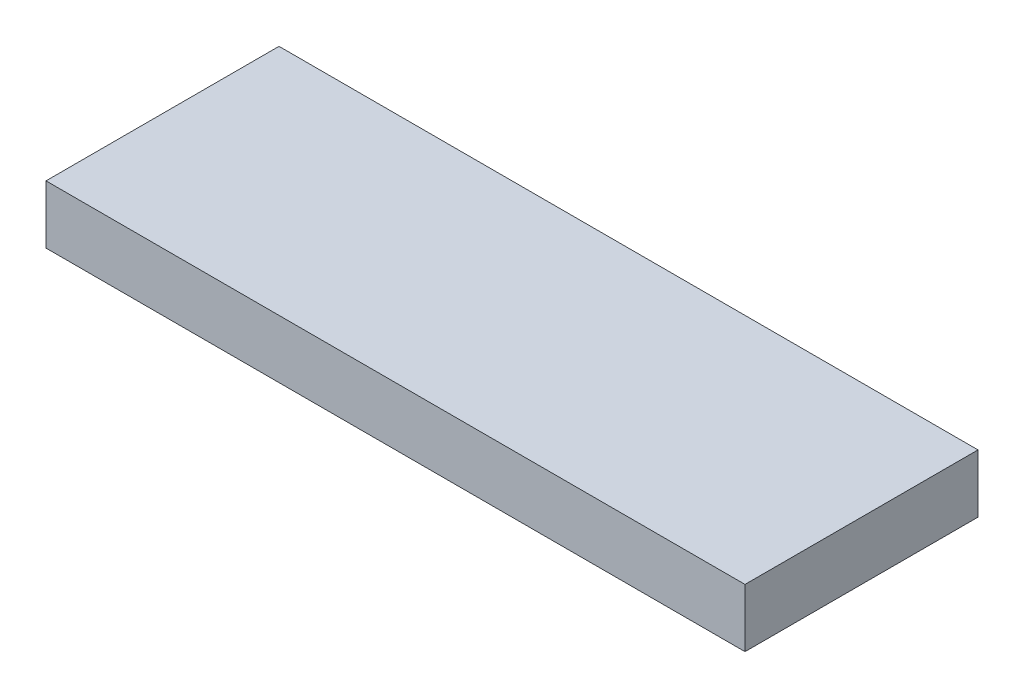
ISO-10303-21;
HEADER;
FILE_DESCRIPTION(('STEP AP214'),'2;1');
FILE_NAME('part.step','',(''),(''),'','','');
FILE_SCHEMA(('AUTOMOTIVE_DESIGN { 1 0 10303 214 1 1 1 1 }'));
ENDSEC;
DATA;
#1=APPLICATION_CONTEXT('core data for automotive mechanical design processes');
#2=APPLICATION_PROTOCOL_DEFINITION('international standard','automotive_design',2000,#1);
#3=PRODUCT_CONTEXT('',#1,'mechanical');
#4=PRODUCT('Part','Part','',(#3));
#5=PRODUCT_RELATED_PRODUCT_CATEGORY('part','',(#4));
#6=PRODUCT_DEFINITION_FORMATION('','',#4);
#7=PRODUCT_DEFINITION_CONTEXT('part definition',#1,'design');
#8=PRODUCT_DEFINITION('design','',#6,#7);
#9=PRODUCT_DEFINITION_SHAPE('','',#8);
#10=(LENGTH_UNIT() NAMED_UNIT(*) SI_UNIT(.MILLI.,.METRE.));
#11=(NAMED_UNIT(*) PLANE_ANGLE_UNIT() SI_UNIT($,.RADIAN.));
#12=(NAMED_UNIT(*) SI_UNIT($,.STERADIAN.) SOLID_ANGLE_UNIT());
#13=UNCERTAINTY_MEASURE_WITH_UNIT(LENGTH_MEASURE(1.E-05),#10,'distance_accuracy_value','');
#14=(GEOMETRIC_REPRESENTATION_CONTEXT(3) GLOBAL_UNCERTAINTY_ASSIGNED_CONTEXT((#13)) GLOBAL_UNIT_ASSIGNED_CONTEXT((#10,
#11,#12)) REPRESENTATION_CONTEXT('',''));
#15=CARTESIAN_POINT('',(0.,0.,0.));
#16=DIRECTION('',(0.,0.,1.));
#17=DIRECTION('',(1.,0.,0.));
#18=AXIS2_PLACEMENT_3D('',#15,#16,#17);
#19=CARTESIAN_POINT('',(-150.,25.,50.));
#20=DIRECTION('',(1.,0.,0.));
#21=DIRECTION('',(0.,0.,-1.));
#22=AXIS2_PLACEMENT_3D('',#19,#20,#21);
#23=PLANE('',#22);
#24=DIRECTION('',(0.,0.,1.));
#25=VECTOR('',#24,1.);
#26=CARTESIAN_POINT('',(-150.,0.,50.));
#27=LINE('',#26,#25);
#28=CARTESIAN_POINT('',(-150.,0.,-50.));
#29=VERTEX_POINT('',#28);
#30=CARTESIAN_POINT('',(-150.,0.,50.));
#31=VERTEX_POINT('',#30);
#32=EDGE_CURVE('E96',#29,#31,#27,.T.);
#33=ORIENTED_EDGE('',*,*,#32,.T.);
#34=DIRECTION('',(0.,-1.,0.));
#35=VECTOR('',#34,1.);
#36=CARTESIAN_POINT('',(-150.,25.,50.));
#37=LINE('',#36,#35);
#38=CARTESIAN_POINT('',(-150.,25.,50.));
#39=VERTEX_POINT('',#38);
#40=EDGE_CURVE('E11',#39,#31,#37,.T.);
#41=ORIENTED_EDGE('',*,*,#40,.F.);
#42=DIRECTION('',(0.,0.,1.));
#43=VECTOR('',#42,1.);
#44=CARTESIAN_POINT('',(-150.,25.,50.));
#45=LINE('',#44,#43);
#46=CARTESIAN_POINT('',(-150.,25.,-50.));
#47=VERTEX_POINT('',#46);
#48=EDGE_CURVE('E84',#47,#39,#45,.T.);
#49=ORIENTED_EDGE('',*,*,#48,.F.);
#50=DIRECTION('',(0.,-1.,0.));
#51=VECTOR('',#50,1.);
#52=CARTESIAN_POINT('',(-150.,25.,-50.));
#53=LINE('',#52,#51);
#54=EDGE_CURVE('E92',#47,#29,#53,.T.);
#55=ORIENTED_EDGE('',*,*,#54,.T.);
#56=EDGE_LOOP('',(#33,#41,#49,#55));
#57=FACE_BOUND('',#56,.T.);
#58=ADVANCED_FACE('F33',(#57),#23,.F.);
#59=CARTESIAN_POINT('',(150.,25.,50.));
#60=DIRECTION('',(0.,0.,-1.));
#61=DIRECTION('',(-1.,0.,0.));
#62=AXIS2_PLACEMENT_3D('',#59,#60,#61);
#63=PLANE('',#62);
#64=DIRECTION('',(1.,0.,0.));
#65=VECTOR('',#64,1.);
#66=CARTESIAN_POINT('',(150.,0.,50.));
#67=LINE('',#66,#65);
#68=CARTESIAN_POINT('',(150.,0.,50.));
#69=VERTEX_POINT('',#68);
#70=EDGE_CURVE('E88',#31,#69,#67,.T.);
#71=ORIENTED_EDGE('',*,*,#70,.T.);
#72=DIRECTION('',(0.,-1.,0.));
#73=VECTOR('',#72,1.);
#74=CARTESIAN_POINT('',(150.,25.,50.));
#75=LINE('',#74,#73);
#76=CARTESIAN_POINT('',(150.,25.,50.));
#77=VERTEX_POINT('',#76);
#78=EDGE_CURVE('E41',#77,#69,#75,.T.);
#79=ORIENTED_EDGE('',*,*,#78,.F.);
#80=DIRECTION('',(1.,0.,0.));
#81=VECTOR('',#80,1.);
#82=CARTESIAN_POINT('',(150.,25.,50.));
#83=LINE('',#82,#81);
#84=EDGE_CURVE('E79',#39,#77,#83,.T.);
#85=ORIENTED_EDGE('',*,*,#84,.F.);
#86=ORIENTED_EDGE('',*,*,#40,.T.);
#87=EDGE_LOOP('',(#71,#79,#85,#86));
#88=FACE_BOUND('',#87,.T.);
#89=ADVANCED_FACE('F87',(#88),#63,.F.);
#90=CARTESIAN_POINT('',(150.,25.,50.));
#91=DIRECTION('',(-1.,0.,0.));
#92=DIRECTION('',(0.,0.,1.));
#93=AXIS2_PLACEMENT_3D('',#90,#91,#92);
#94=PLANE('',#93);
#95=DIRECTION('',(0.,0.,-1.));
#96=VECTOR('',#95,1.);
#97=CARTESIAN_POINT('',(150.,0.,50.));
#98=LINE('',#97,#96);
#99=CARTESIAN_POINT('',(150.,0.,-50.));
#100=VERTEX_POINT('',#99);
#101=EDGE_CURVE('E66',#69,#100,#98,.T.);
#102=ORIENTED_EDGE('',*,*,#101,.T.);
#103=DIRECTION('',(0.,-1.,0.));
#104=VECTOR('',#103,1.);
#105=CARTESIAN_POINT('',(150.,25.,-50.));
#106=LINE('',#105,#104);
#107=CARTESIAN_POINT('',(150.,25.,-50.));
#108=VERTEX_POINT('',#107);
#109=EDGE_CURVE('E89',#108,#100,#106,.T.);
#110=ORIENTED_EDGE('',*,*,#109,.F.);
#111=DIRECTION('',(0.,0.,-1.));
#112=VECTOR('',#111,1.);
#113=CARTESIAN_POINT('',(150.,25.,50.));
#114=LINE('',#113,#112);
#115=EDGE_CURVE('E82',#77,#108,#114,.T.);
#116=ORIENTED_EDGE('',*,*,#115,.F.);
#117=ORIENTED_EDGE('',*,*,#78,.T.);
#118=EDGE_LOOP('',(#102,#110,#116,#117));
#119=FACE_BOUND('',#118,.T.);
#120=ADVANCED_FACE('F90',(#119),#94,.F.);
#121=CARTESIAN_POINT('',(150.,25.,-50.));
#122=DIRECTION('',(0.,0.,1.));
#123=DIRECTION('',(1.,0.,0.));
#124=AXIS2_PLACEMENT_3D('',#121,#122,#123);
#125=PLANE('',#124);
#126=DIRECTION('',(-1.,0.,0.));
#127=VECTOR('',#126,1.);
#128=CARTESIAN_POINT('',(150.,0.,-50.));
#129=LINE('',#128,#127);
#130=EDGE_CURVE('E72',#100,#29,#129,.T.);
#131=ORIENTED_EDGE('',*,*,#130,.T.);
#132=ORIENTED_EDGE('',*,*,#54,.F.);
#133=DIRECTION('',(-1.,0.,0.));
#134=VECTOR('',#133,1.);
#135=CARTESIAN_POINT('',(150.,25.,-50.));
#136=LINE('',#135,#134);
#137=EDGE_CURVE('E49',#108,#47,#136,.T.);
#138=ORIENTED_EDGE('',*,*,#137,.F.);
#139=ORIENTED_EDGE('',*,*,#109,.T.);
#140=EDGE_LOOP('',(#131,#132,#138,#139));
#141=FACE_BOUND('',#140,.T.);
#142=ADVANCED_FACE('F103',(#141),#125,.F.);
#143=CARTESIAN_POINT('',(0.,25.,0.));
#144=DIRECTION('',(0.,1.,0.));
#145=DIRECTION('',(0.,0.,1.));
#146=AXIS2_PLACEMENT_3D('',#143,#144,#145);
#147=PLANE('',#146);
#148=ORIENTED_EDGE('',*,*,#48,.T.);
#149=ORIENTED_EDGE('',*,*,#84,.T.);
#150=ORIENTED_EDGE('',*,*,#115,.T.);
#151=ORIENTED_EDGE('',*,*,#137,.T.);
#152=EDGE_LOOP('',(#148,#149,#150,#151));
#153=FACE_BOUND('',#152,.T.);
#154=ADVANCED_FACE('F80',(#153),#147,.T.);
#155=CARTESIAN_POINT('',(0.,0.,0.));
#156=DIRECTION('',(0.,1.,0.));
#157=DIRECTION('',(0.,0.,1.));
#158=AXIS2_PLACEMENT_3D('',#155,#156,#157);
#159=PLANE('',#158);
#160=ORIENTED_EDGE('',*,*,#32,.F.);
#161=ORIENTED_EDGE('',*,*,#130,.F.);
#162=ORIENTED_EDGE('',*,*,#101,.F.);
#163=ORIENTED_EDGE('',*,*,#70,.F.);
#164=EDGE_LOOP('',(#160,#161,#162,#163));
#165=FACE_BOUND('',#164,.T.);
#166=ADVANCED_FACE('F106',(#165),#159,.F.);
#167=CLOSED_SHELL('',(#58,#89,#120,#142,#154,#166));
#168=MANIFOLD_SOLID_BREP('B2',#167);
#169=ADVANCED_BREP_SHAPE_REPRESENTATION('',(#18,#168),#14);
#170=SHAPE_DEFINITION_REPRESENTATION(#9,#169);
ENDSEC;
END-ISO-10303-21;
